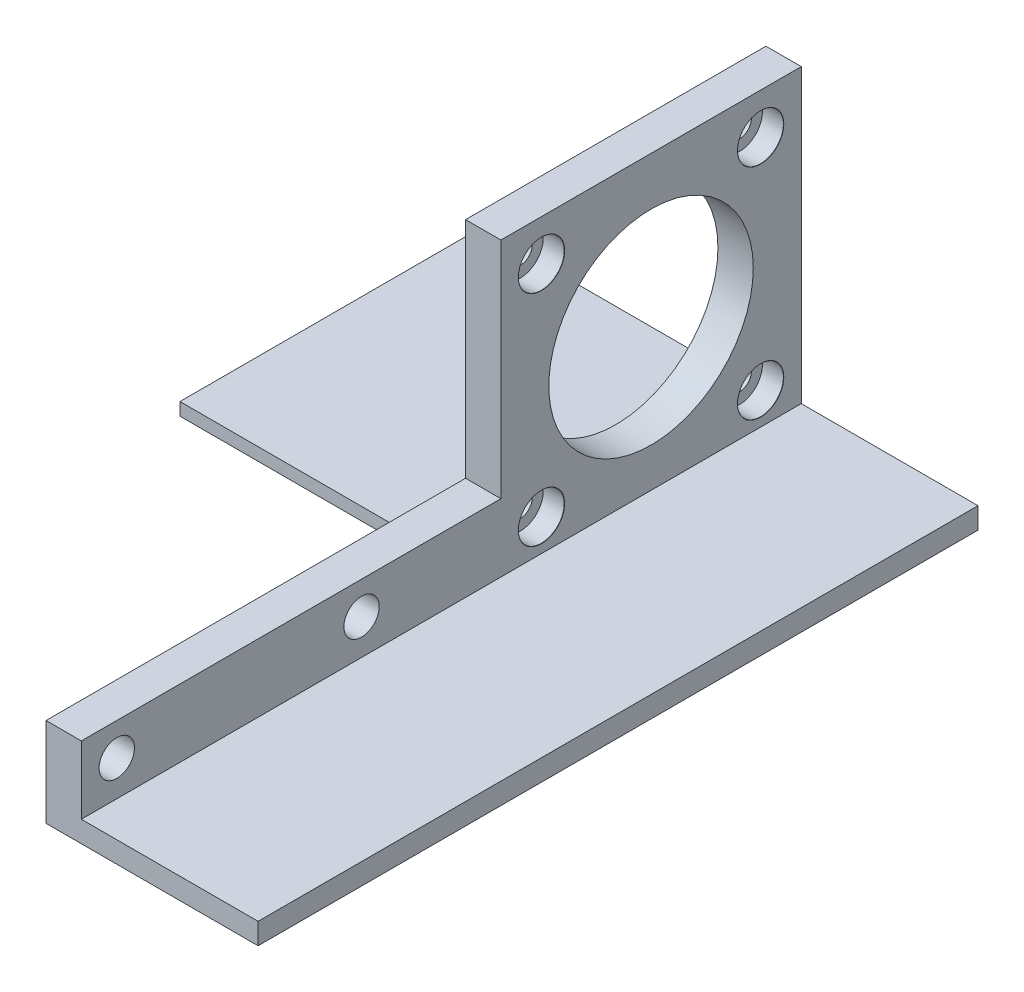
ISO-10303-21;
HEADER;
FILE_DESCRIPTION(('STEP AP214'),'2;1');
FILE_NAME('part.step','',(''),(''),'','','');
FILE_SCHEMA(('AUTOMOTIVE_DESIGN { 1 0 10303 214 1 1 1 1 }'));
ENDSEC;
DATA;
#1=APPLICATION_CONTEXT('core data for automotive mechanical design processes');
#2=APPLICATION_PROTOCOL_DEFINITION('international standard','automotive_design',2000,#1);
#3=PRODUCT_CONTEXT('',#1,'mechanical');
#4=PRODUCT('Part','Part','',(#3));
#5=PRODUCT_RELATED_PRODUCT_CATEGORY('part','',(#4));
#6=PRODUCT_DEFINITION_FORMATION('','',#4);
#7=PRODUCT_DEFINITION_CONTEXT('part definition',#1,'design');
#8=PRODUCT_DEFINITION('design','',#6,#7);
#9=PRODUCT_DEFINITION_SHAPE('','',#8);
#10=(LENGTH_UNIT() NAMED_UNIT(*) SI_UNIT(.MILLI.,.METRE.));
#11=(NAMED_UNIT(*) PLANE_ANGLE_UNIT() SI_UNIT($,.RADIAN.));
#12=(NAMED_UNIT(*) SI_UNIT($,.STERADIAN.) SOLID_ANGLE_UNIT());
#13=UNCERTAINTY_MEASURE_WITH_UNIT(LENGTH_MEASURE(1.E-05),#10,'distance_accuracy_value','');
#14=(GEOMETRIC_REPRESENTATION_CONTEXT(3) GLOBAL_UNCERTAINTY_ASSIGNED_CONTEXT((#13)) GLOBAL_UNIT_ASSIGNED_CONTEXT((#10,
#11,#12)) REPRESENTATION_CONTEXT('',''));
#15=CARTESIAN_POINT('',(0.,0.,0.));
#16=DIRECTION('',(0.,0.,1.));
#17=DIRECTION('',(1.,0.,0.));
#18=AXIS2_PLACEMENT_3D('',#15,#16,#17);
#19=CARTESIAN_POINT('',(-100.424663917664,-3.,-13.7634487006737));
#20=DIRECTION('',(0.,0.,-1.));
#21=DIRECTION('',(-1.,0.,0.));
#22=AXIS2_PLACEMENT_3D('',#19,#20,#21);
#23=PLANE('',#22);
#24=DIRECTION('',(1.,0.,0.));
#25=VECTOR('',#24,1.);
#26=CARTESIAN_POINT('',(-78.1718470904455,9.59999999999998,-13.7634487006737));
#27=LINE('',#26,#25);
#28=CARTESIAN_POINT('',(-17.5,9.59999999999998,-13.7634487006737));
#29=VERTEX_POINT('',#28);
#30=CARTESIAN_POINT('',(-12.5,9.59999999999998,-13.7634487006737));
#31=VERTEX_POINT('',#30);
#32=EDGE_CURVE('E71',#29,#31,#27,.T.);
#33=ORIENTED_EDGE('',*,*,#32,.T.);
#34=DIRECTION('',(0.,1.,0.));
#35=VECTOR('',#34,1.);
#36=CARTESIAN_POINT('',(-12.5,-1.2,-13.7634487006737));
#37=LINE('',#36,#35);
#38=CARTESIAN_POINT('',(-12.5,41.2865512993263,-13.7634487006737));
#39=VERTEX_POINT('',#38);
#40=EDGE_CURVE('E156',#31,#39,#37,.T.);
#41=ORIENTED_EDGE('',*,*,#40,.T.);
#42=DIRECTION('',(1.,0.,0.));
#43=VECTOR('',#42,1.);
#44=CARTESIAN_POINT('',(-77.5850570659675,41.2865512993263,-13.7634487006737));
#45=LINE('',#44,#43);
#46=CARTESIAN_POINT('',(-17.5,41.2865512993263,-13.7634487006737));
#47=VERTEX_POINT('',#46);
#48=EDGE_CURVE('E265',#47,#39,#45,.T.);
#49=ORIENTED_EDGE('',*,*,#48,.F.);
#50=DIRECTION('',(0.,-1.,0.));
#51=VECTOR('',#50,1.);
#52=CARTESIAN_POINT('',(-17.5,-1.2,-13.7634487006737));
#53=LINE('',#52,#51);
#54=EDGE_CURVE('E240',#47,#29,#53,.T.);
#55=ORIENTED_EDGE('',*,*,#54,.T.);
#56=EDGE_LOOP('',(#33,#41,#49,#55));
#57=FACE_BOUND('',#56,.T.);
#58=ADVANCED_FACE('F45',(#57),#23,.F.);
#59=DIRECTION('',(0.,1.,0.));
#60=VECTOR('',#59,1.);
#61=CARTESIAN_POINT('',(-17.5,-2.99999999999999,-13.7634487006737));
#62=LINE('',#61,#60);
#63=CARTESIAN_POINT('',(-17.5,-3.,-13.7634487006737));
#64=VERTEX_POINT('',#63);
#65=CARTESIAN_POINT('',(-17.5,-1.2,-13.7634487006737));
#66=VERTEX_POINT('',#65);
#67=EDGE_CURVE('E166',#64,#66,#62,.T.);
#68=ORIENTED_EDGE('',*,*,#67,.T.);
#69=DIRECTION('',(1.,0.,0.));
#70=VECTOR('',#69,1.);
#71=CARTESIAN_POINT('',(-100.424663917664,-1.2,-13.7634487006737));
#72=LINE('',#71,#70);
#73=CARTESIAN_POINT('',(-57.9,-1.2,-13.7634487006737));
#74=VERTEX_POINT('',#73);
#75=EDGE_CURVE('E288',#74,#66,#72,.T.);
#76=ORIENTED_EDGE('',*,*,#75,.F.);
#77=DIRECTION('',(0.,-1.,0.));
#78=VECTOR('',#77,1.);
#79=CARTESIAN_POINT('',(-57.9,-3.,-13.7634487006737));
#80=LINE('',#79,#78);
#81=CARTESIAN_POINT('',(-57.9,-3.,-13.7634487006737));
#82=VERTEX_POINT('',#81);
#83=EDGE_CURVE('E272',#74,#82,#80,.T.);
#84=ORIENTED_EDGE('',*,*,#83,.T.);
#85=DIRECTION('',(1.,0.,0.));
#86=VECTOR('',#85,1.);
#87=CARTESIAN_POINT('',(-100.424663917664,-3.,-13.7634487006737));
#88=LINE('',#87,#86);
#89=EDGE_CURVE('E63',#82,#64,#88,.T.);
#90=ORIENTED_EDGE('',*,*,#89,.T.);
#91=EDGE_LOOP('',(#68,#76,#84,#90));
#92=FACE_BOUND('',#91,.T.);
#93=ADVANCED_FACE('F355',(#92),#23,.F.);
#94=CARTESIAN_POINT('',(-100.424663917664,-1.2,-56.25));
#95=DIRECTION('',(0.,-1.,0.));
#96=DIRECTION('',(0.,0.,-1.));
#97=AXIS2_PLACEMENT_3D('',#94,#95,#96);
#98=PLANE('',#97);
#99=DIRECTION('',(0.,0.,-1.));
#100=VECTOR('',#99,1.);
#101=CARTESIAN_POINT('',(-17.5,-1.2,-56.25));
#102=LINE('',#101,#100);
#103=CARTESIAN_POINT('',(-17.5,-1.2,-56.25));
#104=VERTEX_POINT('',#103);
#105=EDGE_CURVE('E243',#66,#104,#102,.T.);
#106=ORIENTED_EDGE('',*,*,#105,.T.);
#107=DIRECTION('',(1.,0.,0.));
#108=VECTOR('',#107,1.);
#109=CARTESIAN_POINT('',(-100.424663917664,-1.2,-56.25));
#110=LINE('',#109,#108);
#111=CARTESIAN_POINT('',(-57.9,-1.2,-56.25));
#112=VERTEX_POINT('',#111);
#113=EDGE_CURVE('E251',#112,#104,#110,.T.);
#114=ORIENTED_EDGE('',*,*,#113,.F.);
#115=DIRECTION('',(0.,0.,1.));
#116=VECTOR('',#115,1.);
#117=CARTESIAN_POINT('',(-57.9,-1.2,-56.25));
#118=LINE('',#117,#116);
#119=EDGE_CURVE('E276',#112,#74,#118,.T.);
#120=ORIENTED_EDGE('',*,*,#119,.T.);
#121=ORIENTED_EDGE('',*,*,#75,.T.);
#122=EDGE_LOOP('',(#106,#114,#120,#121));
#123=FACE_BOUND('',#122,.T.);
#124=ADVANCED_FACE('F361',(#123),#98,.F.);
#125=CARTESIAN_POINT('',(-114.379808319264,-3.,45.5856290458793));
#126=DIRECTION('',(0.,-1.,0.));
#127=DIRECTION('',(0.,0.,-1.));
#128=AXIS2_PLACEMENT_3D('',#125,#126,#127);
#129=PLANE('',#128);
#130=DIRECTION('',(1.,0.,0.));
#131=VECTOR('',#130,1.);
#132=CARTESIAN_POINT('',(-114.379808319264,-3.,45.5856290458793));
#133=LINE('',#132,#131);
#134=CARTESIAN_POINT('',(-17.5,-3.,45.5856290458793));
#135=VERTEX_POINT('',#134);
#136=CARTESIAN_POINT('',(12.5,-3.,45.5856290458793));
#137=VERTEX_POINT('',#136);
#138=EDGE_CURVE('E11',#135,#137,#133,.T.);
#139=ORIENTED_EDGE('',*,*,#138,.F.);
#140=DIRECTION('',(0.,0.,-1.));
#141=VECTOR('',#140,1.);
#142=CARTESIAN_POINT('',(-17.5,-3.,45.5856290458793));
#143=LINE('',#142,#141);
#144=EDGE_CURVE('E152',#135,#64,#143,.T.);
#145=ORIENTED_EDGE('',*,*,#144,.T.);
#146=ORIENTED_EDGE('',*,*,#89,.F.);
#147=DIRECTION('',(0.,0.,-1.));
#148=VECTOR('',#147,1.);
#149=CARTESIAN_POINT('',(-57.9,-3.,-56.25));
#150=LINE('',#149,#148);
#151=CARTESIAN_POINT('',(-57.9,-3.,-56.25));
#152=VERTEX_POINT('',#151);
#153=EDGE_CURVE('E275',#82,#152,#150,.T.);
#154=ORIENTED_EDGE('',*,*,#153,.T.);
#155=DIRECTION('',(1.,0.,0.));
#156=VECTOR('',#155,1.);
#157=CARTESIAN_POINT('',(-114.379808319264,-3.,-56.25));
#158=LINE('',#157,#156);
#159=CARTESIAN_POINT('',(12.5,-3.,-56.25));
#160=VERTEX_POINT('',#159);
#161=EDGE_CURVE('E315',#152,#160,#158,.T.);
#162=ORIENTED_EDGE('',*,*,#161,.T.);
#163=DIRECTION('',(0.,0.,-1.));
#164=VECTOR('',#163,1.);
#165=CARTESIAN_POINT('',(12.5,-3.,45.5856290458793));
#166=LINE('',#165,#164);
#167=EDGE_CURVE('E302',#137,#160,#166,.T.);
#168=ORIENTED_EDGE('',*,*,#167,.F.);
#169=EDGE_LOOP('',(#139,#145,#146,#154,#162,#168));
#170=FACE_BOUND('',#169,.T.);
#171=ADVANCED_FACE('F47',(#170),#129,.T.);
#172=CARTESIAN_POINT('',(-114.379808319264,0.,-56.2500000000001));
#173=DIRECTION('',(0.,0.,1.));
#174=DIRECTION('',(0.,-1.,0.));
#175=AXIS2_PLACEMENT_3D('',#172,#173,#174);
#176=PLANE('',#175);
#177=DIRECTION('',(0.,-1.,0.));
#178=VECTOR('',#177,1.);
#179=CARTESIAN_POINT('',(-12.5,-1.2,-56.25));
#180=LINE('',#179,#178);
#181=CARTESIAN_POINT('',(-12.5,41.2865512993263,-56.25));
#182=VERTEX_POINT('',#181);
#183=CARTESIAN_POINT('',(-12.5,0.,-56.2500000000001));
#184=VERTEX_POINT('',#183);
#185=EDGE_CURVE('E252',#182,#184,#180,.T.);
#186=ORIENTED_EDGE('',*,*,#185,.T.);
#187=DIRECTION('',(1.,0.,0.));
#188=VECTOR('',#187,1.);
#189=CARTESIAN_POINT('',(-114.379808319264,0.,-56.2500000000001));
#190=LINE('',#189,#188);
#191=CARTESIAN_POINT('',(12.5,0.,-56.2500000000001));
#192=VERTEX_POINT('',#191);
#193=EDGE_CURVE('E318',#184,#192,#190,.T.);
#194=ORIENTED_EDGE('',*,*,#193,.T.);
#195=DIRECTION('',(0.,-1.,0.));
#196=VECTOR('',#195,1.);
#197=CARTESIAN_POINT('',(12.5,0.,-56.2500000000001));
#198=LINE('',#197,#196);
#199=EDGE_CURVE('E301',#192,#160,#198,.T.);
#200=ORIENTED_EDGE('',*,*,#199,.T.);
#201=ORIENTED_EDGE('',*,*,#161,.F.);
#202=DIRECTION('',(0.,1.,0.));
#203=VECTOR('',#202,1.);
#204=CARTESIAN_POINT('',(-57.9,-3.,-56.25));
#205=LINE('',#204,#203);
#206=EDGE_CURVE('E280',#152,#112,#205,.T.);
#207=ORIENTED_EDGE('',*,*,#206,.T.);
#208=ORIENTED_EDGE('',*,*,#113,.T.);
#209=DIRECTION('',(0.,1.,0.));
#210=VECTOR('',#209,1.);
#211=CARTESIAN_POINT('',(-17.5,-1.2,-56.25));
#212=LINE('',#211,#210);
#213=CARTESIAN_POINT('',(-17.5,41.2865512993263,-56.25));
#214=VERTEX_POINT('',#213);
#215=EDGE_CURVE('E247',#104,#214,#212,.T.);
#216=ORIENTED_EDGE('',*,*,#215,.T.);
#217=DIRECTION('',(1.,0.,0.));
#218=VECTOR('',#217,1.);
#219=CARTESIAN_POINT('',(-77.5850570659675,41.2865512993263,-56.25));
#220=LINE('',#219,#218);
#221=EDGE_CURVE('E262',#214,#182,#220,.T.);
#222=ORIENTED_EDGE('',*,*,#221,.T.);
#223=EDGE_LOOP('',(#186,#194,#200,#201,#207,#208,#216,#222));
#224=FACE_BOUND('',#223,.T.);
#225=ADVANCED_FACE('F374',(#224),#176,.F.);
#226=CARTESIAN_POINT('',(-114.379808319264,0.,45.5856290458793));
#227=DIRECTION('',(0.,-1.,0.));
#228=DIRECTION('',(0.,0.,-1.));
#229=AXIS2_PLACEMENT_3D('',#226,#227,#228);
#230=PLANE('',#229);
#231=DIRECTION('',(0.,0.,-1.));
#232=VECTOR('',#231,1.);
#233=CARTESIAN_POINT('',(-12.5,0.,45.5856290458793));
#234=LINE('',#233,#232);
#235=CARTESIAN_POINT('',(-12.5,0.,45.5856290458793));
#236=VERTEX_POINT('',#235);
#237=EDGE_CURVE('E312',#236,#184,#234,.T.);
#238=ORIENTED_EDGE('',*,*,#237,.F.);
#239=DIRECTION('',(1.,0.,0.));
#240=VECTOR('',#239,1.);
#241=CARTESIAN_POINT('',(-114.379808319264,0.,45.5856290458793));
#242=LINE('',#241,#240);
#243=CARTESIAN_POINT('',(12.5,0.,45.5856290458793));
#244=VERTEX_POINT('',#243);
#245=EDGE_CURVE('E55',#236,#244,#242,.T.);
#246=ORIENTED_EDGE('',*,*,#245,.T.);
#247=DIRECTION('',(0.,0.,-1.));
#248=VECTOR('',#247,1.);
#249=CARTESIAN_POINT('',(12.5,0.,45.5856290458793));
#250=LINE('',#249,#248);
#251=EDGE_CURVE('E297',#244,#192,#250,.T.);
#252=ORIENTED_EDGE('',*,*,#251,.T.);
#253=ORIENTED_EDGE('',*,*,#193,.F.);
#254=EDGE_LOOP('',(#238,#246,#252,#253));
#255=FACE_BOUND('',#254,.T.);
#256=ADVANCED_FACE('F372',(#255),#230,.F.);
#257=CARTESIAN_POINT('',(-114.379808319264,0.,45.5856290458793));
#258=DIRECTION('',(0.,0.,1.));
#259=DIRECTION('',(1.,0.,0.));
#260=AXIS2_PLACEMENT_3D('',#257,#258,#259);
#261=PLANE('',#260);
#262=ORIENTED_EDGE('',*,*,#245,.F.);
#263=DIRECTION('',(0.,1.,0.));
#264=VECTOR('',#263,1.);
#265=CARTESIAN_POINT('',(-12.5,-3.,45.5856290458793));
#266=LINE('',#265,#264);
#267=CARTESIAN_POINT('',(-12.5,9.59999999999999,45.5856290458793));
#268=VERTEX_POINT('',#267);
#269=EDGE_CURVE('E132',#236,#268,#266,.T.);
#270=ORIENTED_EDGE('',*,*,#269,.T.);
#271=DIRECTION('',(1.,0.,0.));
#272=VECTOR('',#271,1.);
#273=CARTESIAN_POINT('',(-78.1718470904455,9.59999999999999,45.5856290458793));
#274=LINE('',#273,#272);
#275=CARTESIAN_POINT('',(-17.5,9.59999999999999,45.5856290458793));
#276=VERTEX_POINT('',#275);
#277=EDGE_CURVE('E136',#276,#268,#274,.T.);
#278=ORIENTED_EDGE('',*,*,#277,.F.);
#279=DIRECTION('',(0.,-1.,0.));
#280=VECTOR('',#279,1.);
#281=CARTESIAN_POINT('',(-17.5,-2.99999999999999,45.5856290458793));
#282=LINE('',#281,#280);
#283=EDGE_CURVE('E171',#276,#135,#282,.T.);
#284=ORIENTED_EDGE('',*,*,#283,.T.);
#285=ORIENTED_EDGE('',*,*,#138,.T.);
#286=DIRECTION('',(0.,-1.,0.));
#287=VECTOR('',#286,1.);
#288=CARTESIAN_POINT('',(12.5,0.,45.5856290458793));
#289=LINE('',#288,#287);
#290=EDGE_CURVE('E284',#244,#137,#289,.T.);
#291=ORIENTED_EDGE('',*,*,#290,.F.);
#292=EDGE_LOOP('',(#262,#270,#278,#284,#285,#291));
#293=FACE_BOUND('',#292,.T.);
#294=ADVANCED_FACE('F134',(#293),#261,.T.);
#295=CARTESIAN_POINT('',(12.5,0.,0.));
#296=DIRECTION('',(1.,0.,0.));
#297=DIRECTION('',(0.,0.,-1.));
#298=AXIS2_PLACEMENT_3D('',#295,#296,#297);
#299=PLANE('',#298);
#300=ORIENTED_EDGE('',*,*,#251,.F.);
#301=ORIENTED_EDGE('',*,*,#290,.T.);
#302=ORIENTED_EDGE('',*,*,#167,.T.);
#303=ORIENTED_EDGE('',*,*,#199,.F.);
#304=EDGE_LOOP('',(#300,#301,#302,#303));
#305=FACE_BOUND('',#304,.T.);
#306=ADVANCED_FACE('F365',(#305),#299,.T.);
#307=CARTESIAN_POINT('',(-57.9,20.,-35.));
#308=DIRECTION('',(1.,0.,0.));
#309=DIRECTION('',(0.,0.,-1.));
#310=AXIS2_PLACEMENT_3D('',#307,#308,#309);
#311=PLANE('',#310);
#312=ORIENTED_EDGE('',*,*,#153,.F.);
#313=ORIENTED_EDGE('',*,*,#83,.F.);
#314=ORIENTED_EDGE('',*,*,#119,.F.);
#315=ORIENTED_EDGE('',*,*,#206,.F.);
#316=EDGE_LOOP('',(#312,#313,#314,#315));
#317=FACE_BOUND('',#316,.T.);
#318=ADVANCED_FACE('F368',(#317),#311,.F.);
#319=CARTESIAN_POINT('',(-12.5,0.,0.));
#320=DIRECTION('',(1.,0.,0.));
#321=DIRECTION('',(0.,0.,-1.));
#322=AXIS2_PLACEMENT_3D('',#319,#320,#321);
#323=PLANE('',#322);
#324=CARTESIAN_POINT('',(-12.5,5.,5.94999999999999));
#325=DIRECTION('',(1.,0.,0.));
#326=DIRECTION('',(0.,0.,-1.));
#327=AXIS2_PLACEMENT_3D('',#324,#325,#326);
#328=CIRCLE('',#327,2.5);
#329=CARTESIAN_POINT('',(-12.5,5.,3.44999999999999));
#330=VERTEX_POINT('',#329);
#331=EDGE_CURVE('E144',#330,#330,#328,.T.);
#332=ORIENTED_EDGE('',*,*,#331,.F.);
#333=EDGE_LOOP('',(#332));
#334=FACE_BOUND('',#333,.T.);
#335=CARTESIAN_POINT('',(-12.5,4.99999999999999,40.5741705012821));
#336=DIRECTION('',(1.,0.,0.));
#337=DIRECTION('',(0.,0.,-1.));
#338=AXIS2_PLACEMENT_3D('',#335,#336,#337);
#339=CIRCLE('',#338,2.49999999999999);
#340=CARTESIAN_POINT('',(-12.5,4.99999999999999,38.0741705012821));
#341=VERTEX_POINT('',#340);
#342=EDGE_CURVE('E700',#341,#341,#339,.T.);
#343=ORIENTED_EDGE('',*,*,#342,.F.);
#344=EDGE_LOOP('',(#343));
#345=FACE_BOUND('',#344,.T.);
#346=CARTESIAN_POINT('',(-12.5,20.,-35.));
#347=DIRECTION('',(1.,0.,0.));
#348=DIRECTION('',(0.,0.,-1.));
#349=AXIS2_PLACEMENT_3D('',#346,#347,#348);
#350=CIRCLE('',#349,14.462);
#351=CARTESIAN_POINT('',(-12.5,20.,-49.462));
#352=VERTEX_POINT('',#351);
#353=EDGE_CURVE('E167',#352,#352,#350,.T.);
#354=ORIENTED_EDGE('',*,*,#353,.F.);
#355=EDGE_LOOP('',(#354));
#356=FACE_BOUND('',#355,.T.);
#357=CARTESIAN_POINT('',(-12.5,4.5,-19.5));
#358=DIRECTION('',(1.,0.,0.));
#359=DIRECTION('',(0.,0.,-1.));
#360=AXIS2_PLACEMENT_3D('',#357,#358,#359);
#361=CIRCLE('',#360,3.275);
#362=CARTESIAN_POINT('',(-12.5,4.5,-22.775));
#363=VERTEX_POINT('',#362);
#364=EDGE_CURVE('E172',#363,#363,#361,.T.);
#365=ORIENTED_EDGE('',*,*,#364,.F.);
#366=EDGE_LOOP('',(#365));
#367=FACE_BOUND('',#366,.T.);
#368=CARTESIAN_POINT('',(-12.5,4.50000000000001,-50.5));
#369=DIRECTION('',(1.,0.,0.));
#370=DIRECTION('',(0.,0.,-1.));
#371=AXIS2_PLACEMENT_3D('',#368,#369,#370);
#372=CIRCLE('',#371,3.275);
#373=CARTESIAN_POINT('',(-12.5,4.50000000000001,-53.775));
#374=VERTEX_POINT('',#373);
#375=EDGE_CURVE('E189',#374,#374,#372,.T.);
#376=ORIENTED_EDGE('',*,*,#375,.F.);
#377=EDGE_LOOP('',(#376));
#378=FACE_BOUND('',#377,.T.);
#379=CARTESIAN_POINT('',(-12.5,35.5,-50.5));
#380=DIRECTION('',(1.,0.,0.));
#381=DIRECTION('',(0.,0.,-1.));
#382=AXIS2_PLACEMENT_3D('',#379,#380,#381);
#383=CIRCLE('',#382,3.275);
#384=CARTESIAN_POINT('',(-12.5,35.5,-53.775));
#385=VERTEX_POINT('',#384);
#386=EDGE_CURVE('E206',#385,#385,#383,.T.);
#387=ORIENTED_EDGE('',*,*,#386,.F.);
#388=EDGE_LOOP('',(#387));
#389=FACE_BOUND('',#388,.T.);
#390=CARTESIAN_POINT('',(-12.5,35.5,-19.5));
#391=DIRECTION('',(1.,0.,0.));
#392=DIRECTION('',(0.,0.,-1.));
#393=AXIS2_PLACEMENT_3D('',#390,#391,#392);
#394=CIRCLE('',#393,3.275);
#395=CARTESIAN_POINT('',(-12.5,35.5,-22.775));
#396=VERTEX_POINT('',#395);
#397=EDGE_CURVE('E223',#396,#396,#394,.T.);
#398=ORIENTED_EDGE('',*,*,#397,.F.);
#399=EDGE_LOOP('',(#398));
#400=FACE_BOUND('',#399,.T.);
#401=ORIENTED_EDGE('',*,*,#237,.T.);
#402=ORIENTED_EDGE('',*,*,#185,.F.);
#403=DIRECTION('',(0.,0.,-1.));
#404=VECTOR('',#403,1.);
#405=CARTESIAN_POINT('',(-12.5,41.2865512993263,-56.25));
#406=LINE('',#405,#404);
#407=EDGE_CURVE('E258',#39,#182,#406,.T.);
#408=ORIENTED_EDGE('',*,*,#407,.F.);
#409=ORIENTED_EDGE('',*,*,#40,.F.);
#410=DIRECTION('',(0.,0.,-1.));
#411=VECTOR('',#410,1.);
#412=CARTESIAN_POINT('',(-12.5,9.59999999999999,45.5856290458793));
#413=LINE('',#412,#411);
#414=EDGE_CURVE('E143',#268,#31,#413,.T.);
#415=ORIENTED_EDGE('',*,*,#414,.F.);
#416=ORIENTED_EDGE('',*,*,#269,.F.);
#417=EDGE_LOOP('',(#401,#402,#408,#409,#415,#416));
#418=FACE_BOUND('',#417,.T.);
#419=ADVANCED_FACE('F154',(#334,#345,#356,#367,#378,#389,#400,#418),#323,.T.);
#420=CARTESIAN_POINT('',(-77.5850570659675,41.2865512993263,-56.25));
#421=DIRECTION('',(0.,-1.,0.));
#422=DIRECTION('',(0.,0.,-1.));
#423=AXIS2_PLACEMENT_3D('',#420,#421,#422);
#424=PLANE('',#423);
#425=ORIENTED_EDGE('',*,*,#221,.F.);
#426=DIRECTION('',(0.,0.,1.));
#427=VECTOR('',#426,1.);
#428=CARTESIAN_POINT('',(-17.5,41.2865512993263,-56.25));
#429=LINE('',#428,#427);
#430=EDGE_CURVE('E244',#214,#47,#429,.T.);
#431=ORIENTED_EDGE('',*,*,#430,.T.);
#432=ORIENTED_EDGE('',*,*,#48,.T.);
#433=ORIENTED_EDGE('',*,*,#407,.T.);
#434=EDGE_LOOP('',(#425,#431,#432,#433));
#435=FACE_BOUND('',#434,.T.);
#436=ADVANCED_FACE('F432',(#435),#424,.F.);
#437=CARTESIAN_POINT('',(-17.5,20.,-35.));
#438=DIRECTION('',(1.,0.,0.));
#439=DIRECTION('',(0.,0.,-1.));
#440=AXIS2_PLACEMENT_3D('',#437,#438,#439);
#441=PLANE('',#440);
#442=CARTESIAN_POINT('',(-17.5,5.,5.94999999999999));
#443=DIRECTION('',(-1.,0.,0.));
#444=DIRECTION('',(0.,0.,1.));
#445=AXIS2_PLACEMENT_3D('',#442,#443,#444);
#446=CIRCLE('',#445,2.5);
#447=CARTESIAN_POINT('',(-17.5,5.,8.44999999999999));
#448=VERTEX_POINT('',#447);
#449=EDGE_CURVE('E698',#448,#448,#446,.T.);
#450=ORIENTED_EDGE('',*,*,#449,.F.);
#451=EDGE_LOOP('',(#450));
#452=FACE_BOUND('',#451,.T.);
#453=CARTESIAN_POINT('',(-17.5,4.99999999999999,40.5741705012821));
#454=DIRECTION('',(-1.,0.,0.));
#455=DIRECTION('',(0.,0.,1.));
#456=AXIS2_PLACEMENT_3D('',#453,#454,#455);
#457=CIRCLE('',#456,2.49999999999999);
#458=CARTESIAN_POINT('',(-17.5,4.99999999999999,43.0741705012821));
#459=VERTEX_POINT('',#458);
#460=EDGE_CURVE('E701',#459,#459,#457,.T.);
#461=ORIENTED_EDGE('',*,*,#460,.F.);
#462=EDGE_LOOP('',(#461));
#463=FACE_BOUND('',#462,.T.);
#464=CARTESIAN_POINT('',(-17.5,20.,-35.));
#465=DIRECTION('',(1.,0.,0.));
#466=DIRECTION('',(0.,0.,-1.));
#467=AXIS2_PLACEMENT_3D('',#464,#465,#466);
#468=CIRCLE('',#467,14.462);
#469=CARTESIAN_POINT('',(-17.5,20.,-49.462));
#470=VERTEX_POINT('',#469);
#471=EDGE_CURVE('E49',#470,#470,#468,.T.);
#472=ORIENTED_EDGE('',*,*,#471,.T.);
#473=EDGE_LOOP('',(#472));
#474=FACE_BOUND('',#473,.T.);
#475=CARTESIAN_POINT('',(-17.5,4.5,-19.5));
#476=DIRECTION('',(1.,0.,0.));
#477=DIRECTION('',(0.,0.,-1.));
#478=AXIS2_PLACEMENT_3D('',#475,#476,#477);
#479=CIRCLE('',#478,1.7);
#480=CARTESIAN_POINT('',(-17.5,4.5,-21.2));
#481=VERTEX_POINT('',#480);
#482=EDGE_CURVE('E188',#481,#481,#479,.T.);
#483=ORIENTED_EDGE('',*,*,#482,.T.);
#484=EDGE_LOOP('',(#483));
#485=FACE_BOUND('',#484,.T.);
#486=CARTESIAN_POINT('',(-17.5,4.50000000000001,-50.5));
#487=DIRECTION('',(1.,0.,0.));
#488=DIRECTION('',(0.,0.,-1.));
#489=AXIS2_PLACEMENT_3D('',#486,#487,#488);
#490=CIRCLE('',#489,1.7);
#491=CARTESIAN_POINT('',(-17.5,4.50000000000001,-52.2));
#492=VERTEX_POINT('',#491);
#493=EDGE_CURVE('E205',#492,#492,#490,.T.);
#494=ORIENTED_EDGE('',*,*,#493,.T.);
#495=EDGE_LOOP('',(#494));
#496=FACE_BOUND('',#495,.T.);
#497=CARTESIAN_POINT('',(-17.5,35.5,-50.5));
#498=DIRECTION('',(1.,0.,0.));
#499=DIRECTION('',(0.,0.,-1.));
#500=AXIS2_PLACEMENT_3D('',#497,#498,#499);
#501=CIRCLE('',#500,1.7);
#502=CARTESIAN_POINT('',(-17.5,35.5,-52.2));
#503=VERTEX_POINT('',#502);
#504=EDGE_CURVE('E222',#503,#503,#501,.T.);
#505=ORIENTED_EDGE('',*,*,#504,.T.);
#506=EDGE_LOOP('',(#505));
#507=FACE_BOUND('',#506,.T.);
#508=CARTESIAN_POINT('',(-17.5,35.5,-19.5));
#509=DIRECTION('',(1.,0.,0.));
#510=DIRECTION('',(0.,0.,-1.));
#511=AXIS2_PLACEMENT_3D('',#508,#509,#510);
#512=CIRCLE('',#511,1.7);
#513=CARTESIAN_POINT('',(-17.5,35.5,-21.2));
#514=VERTEX_POINT('',#513);
#515=EDGE_CURVE('E239',#514,#514,#512,.T.);
#516=ORIENTED_EDGE('',*,*,#515,.T.);
#517=EDGE_LOOP('',(#516));
#518=FACE_BOUND('',#517,.T.);
#519=ORIENTED_EDGE('',*,*,#105,.F.);
#520=ORIENTED_EDGE('',*,*,#67,.F.);
#521=ORIENTED_EDGE('',*,*,#144,.F.);
#522=ORIENTED_EDGE('',*,*,#283,.F.);
#523=DIRECTION('',(0.,0.,1.));
#524=VECTOR('',#523,1.);
#525=CARTESIAN_POINT('',(-17.5,9.59999999999999,45.5856290458793));
#526=LINE('',#525,#524);
#527=EDGE_CURVE('E150',#29,#276,#526,.T.);
#528=ORIENTED_EDGE('',*,*,#527,.F.);
#529=ORIENTED_EDGE('',*,*,#54,.F.);
#530=ORIENTED_EDGE('',*,*,#430,.F.);
#531=ORIENTED_EDGE('',*,*,#215,.F.);
#532=EDGE_LOOP('',(#519,#520,#521,#522,#528,#529,#530,#531));
#533=FACE_BOUND('',#532,.T.);
#534=ADVANCED_FACE('F335',(#452,#463,#474,#485,#496,#507,#518,#533),#441,.F.);
#535=CARTESIAN_POINT('',(-12.5,35.5,-19.5));
#536=DIRECTION('',(1.,0.,0.));
#537=DIRECTION('',(0.,0.,-1.));
#538=AXIS2_PLACEMENT_3D('',#535,#536,#537);
#539=CYLINDRICAL_SURFACE('',#538,1.7);
#540=CARTESIAN_POINT('',(-15.5,35.5,-19.5));
#541=DIRECTION('',(1.,0.,0.));
#542=DIRECTION('',(0.,0.,-1.));
#543=AXIS2_PLACEMENT_3D('',#540,#541,#542);
#544=CIRCLE('',#543,1.70000000000001);
#545=CARTESIAN_POINT('',(-15.5,35.5,-21.2));
#546=VERTEX_POINT('',#545);
#547=EDGE_CURVE('E235',#546,#546,#544,.T.);
#548=ORIENTED_EDGE('',*,*,#547,.T.);
#549=EDGE_LOOP('',(#548));
#550=FACE_BOUND('',#549,.T.);
#551=ORIENTED_EDGE('',*,*,#515,.F.);
#552=EDGE_LOOP('',(#551));
#553=FACE_BOUND('',#552,.T.);
#554=ADVANCED_FACE('F462',(#550,#553),#539,.F.);
#555=CARTESIAN_POINT('',(-15.5,38.75,-19.5));
#556=DIRECTION('',(-1.,0.,0.));
#557=DIRECTION('',(0.,0.,1.));
#558=AXIS2_PLACEMENT_3D('',#555,#556,#557);
#559=PLANE('',#558);
#560=ORIENTED_EDGE('',*,*,#547,.F.);
#561=EDGE_LOOP('',(#560));
#562=FACE_BOUND('',#561,.T.);
#563=CARTESIAN_POINT('',(-15.5,35.5,-19.5));
#564=DIRECTION('',(1.,0.,0.));
#565=DIRECTION('',(0.,0.,-1.));
#566=AXIS2_PLACEMENT_3D('',#563,#564,#565);
#567=CIRCLE('',#566,3.25);
#568=CARTESIAN_POINT('',(-15.5,35.5,-22.75));
#569=VERTEX_POINT('',#568);
#570=EDGE_CURVE('E231',#569,#569,#567,.T.);
#571=ORIENTED_EDGE('',*,*,#570,.T.);
#572=EDGE_LOOP('',(#571));
#573=FACE_BOUND('',#572,.T.);
#574=ADVANCED_FACE('F454',(#562,#573),#559,.F.);
#575=CARTESIAN_POINT('',(-12.5,35.5,-19.5));
#576=DIRECTION('',(1.,0.,0.));
#577=DIRECTION('',(0.,0.,-1.));
#578=AXIS2_PLACEMENT_3D('',#575,#576,#577);
#579=CYLINDRICAL_SURFACE('',#578,3.25);
#580=ORIENTED_EDGE('',*,*,#570,.F.);
#581=EDGE_LOOP('',(#580));
#582=FACE_BOUND('',#581,.T.);
#583=CARTESIAN_POINT('',(-12.525,35.5,-19.5));
#584=DIRECTION('',(1.,0.,0.));
#585=DIRECTION('',(0.,0.,-1.));
#586=AXIS2_PLACEMENT_3D('',#583,#584,#585);
#587=CIRCLE('',#586,3.25);
#588=CARTESIAN_POINT('',(-12.525,35.5,-22.75));
#589=VERTEX_POINT('',#588);
#590=EDGE_CURVE('E227',#589,#589,#587,.T.);
#591=ORIENTED_EDGE('',*,*,#590,.T.);
#592=EDGE_LOOP('',(#591));
#593=FACE_BOUND('',#592,.T.);
#594=ADVANCED_FACE('F444',(#582,#593),#579,.F.);
#595=CARTESIAN_POINT('',(-12.5,35.5,-19.5));
#596=DIRECTION('',(1.,0.,0.));
#597=DIRECTION('',(0.,0.,-1.));
#598=AXIS2_PLACEMENT_3D('',#595,#596,#597);
#599=CONICAL_SURFACE('',#598,3.275,0.785398163397414);
#600=ORIENTED_EDGE('',*,*,#590,.F.);
#601=EDGE_LOOP('',(#600));
#602=FACE_BOUND('',#601,.T.);
#603=ORIENTED_EDGE('',*,*,#397,.T.);
#604=EDGE_LOOP('',(#603));
#605=FACE_BOUND('',#604,.T.);
#606=ADVANCED_FACE('F441',(#602,#605),#599,.F.);
#607=CARTESIAN_POINT('',(-12.5,35.5,-50.5));
#608=DIRECTION('',(1.,0.,0.));
#609=DIRECTION('',(0.,0.,-1.));
#610=AXIS2_PLACEMENT_3D('',#607,#608,#609);
#611=CYLINDRICAL_SURFACE('',#610,1.7);
#612=CARTESIAN_POINT('',(-15.5,35.5,-50.5));
#613=DIRECTION('',(1.,0.,0.));
#614=DIRECTION('',(0.,0.,-1.));
#615=AXIS2_PLACEMENT_3D('',#612,#613,#614);
#616=CIRCLE('',#615,1.70000000000001);
#617=CARTESIAN_POINT('',(-15.5,35.5,-52.2));
#618=VERTEX_POINT('',#617);
#619=EDGE_CURVE('E218',#618,#618,#616,.T.);
#620=ORIENTED_EDGE('',*,*,#619,.T.);
#621=EDGE_LOOP('',(#620));
#622=FACE_BOUND('',#621,.T.);
#623=ORIENTED_EDGE('',*,*,#504,.F.);
#624=EDGE_LOOP('',(#623));
#625=FACE_BOUND('',#624,.T.);
#626=ADVANCED_FACE('F443',(#622,#625),#611,.F.);
#627=CARTESIAN_POINT('',(-15.5,38.75,-50.5));
#628=DIRECTION('',(-1.,0.,0.));
#629=DIRECTION('',(0.,0.,1.));
#630=AXIS2_PLACEMENT_3D('',#627,#628,#629);
#631=PLANE('',#630);
#632=ORIENTED_EDGE('',*,*,#619,.F.);
#633=EDGE_LOOP('',(#632));
#634=FACE_BOUND('',#633,.T.);
#635=CARTESIAN_POINT('',(-15.5,35.5,-50.5));
#636=DIRECTION('',(1.,0.,0.));
#637=DIRECTION('',(0.,0.,-1.));
#638=AXIS2_PLACEMENT_3D('',#635,#636,#637);
#639=CIRCLE('',#638,3.25);
#640=CARTESIAN_POINT('',(-15.5,35.5,-53.75));
#641=VERTEX_POINT('',#640);
#642=EDGE_CURVE('E214',#641,#641,#639,.T.);
#643=ORIENTED_EDGE('',*,*,#642,.T.);
#644=EDGE_LOOP('',(#643));
#645=FACE_BOUND('',#644,.T.);
#646=ADVANCED_FACE('F451',(#634,#645),#631,.F.);
#647=CARTESIAN_POINT('',(-12.5,35.5,-50.5));
#648=DIRECTION('',(1.,0.,0.));
#649=DIRECTION('',(0.,0.,-1.));
#650=AXIS2_PLACEMENT_3D('',#647,#648,#649);
#651=CYLINDRICAL_SURFACE('',#650,3.25);
#652=ORIENTED_EDGE('',*,*,#642,.F.);
#653=EDGE_LOOP('',(#652));
#654=FACE_BOUND('',#653,.T.);
#655=CARTESIAN_POINT('',(-12.525,35.5,-50.5));
#656=DIRECTION('',(1.,0.,0.));
#657=DIRECTION('',(0.,0.,-1.));
#658=AXIS2_PLACEMENT_3D('',#655,#656,#657);
#659=CIRCLE('',#658,3.25);
#660=CARTESIAN_POINT('',(-12.525,35.5,-53.75));
#661=VERTEX_POINT('',#660);
#662=EDGE_CURVE('E210',#661,#661,#659,.T.);
#663=ORIENTED_EDGE('',*,*,#662,.T.);
#664=EDGE_LOOP('',(#663));
#665=FACE_BOUND('',#664,.T.);
#666=ADVANCED_FACE('F534',(#654,#665),#651,.F.);
#667=CARTESIAN_POINT('',(-12.5,35.5,-50.5));
#668=DIRECTION('',(1.,0.,0.));
#669=DIRECTION('',(0.,0.,-1.));
#670=AXIS2_PLACEMENT_3D('',#667,#668,#669);
#671=CONICAL_SURFACE('',#670,3.275,0.785398163397414);
#672=ORIENTED_EDGE('',*,*,#662,.F.);
#673=EDGE_LOOP('',(#672));
#674=FACE_BOUND('',#673,.T.);
#675=ORIENTED_EDGE('',*,*,#386,.T.);
#676=EDGE_LOOP('',(#675));
#677=FACE_BOUND('',#676,.T.);
#678=ADVANCED_FACE('F542',(#674,#677),#671,.F.);
#679=CARTESIAN_POINT('',(-12.5,4.50000000000001,-50.5));
#680=DIRECTION('',(1.,0.,0.));
#681=DIRECTION('',(0.,0.,-1.));
#682=AXIS2_PLACEMENT_3D('',#679,#680,#681);
#683=CYLINDRICAL_SURFACE('',#682,1.7);
#684=CARTESIAN_POINT('',(-15.5,4.50000000000001,-50.5));
#685=DIRECTION('',(1.,0.,0.));
#686=DIRECTION('',(0.,0.,-1.));
#687=AXIS2_PLACEMENT_3D('',#684,#685,#686);
#688=CIRCLE('',#687,1.7);
#689=CARTESIAN_POINT('',(-15.5,4.50000000000001,-52.2));
#690=VERTEX_POINT('',#689);
#691=EDGE_CURVE('E201',#690,#690,#688,.T.);
#692=ORIENTED_EDGE('',*,*,#691,.T.);
#693=EDGE_LOOP('',(#692));
#694=FACE_BOUND('',#693,.T.);
#695=ORIENTED_EDGE('',*,*,#493,.F.);
#696=EDGE_LOOP('',(#695));
#697=FACE_BOUND('',#696,.T.);
#698=ADVANCED_FACE('F551',(#694,#697),#683,.F.);
#699=CARTESIAN_POINT('',(-15.5,7.75000000000001,-50.5));
#700=DIRECTION('',(-1.,0.,0.));
#701=DIRECTION('',(0.,0.,1.));
#702=AXIS2_PLACEMENT_3D('',#699,#700,#701);
#703=PLANE('',#702);
#704=ORIENTED_EDGE('',*,*,#691,.F.);
#705=EDGE_LOOP('',(#704));
#706=FACE_BOUND('',#705,.T.);
#707=CARTESIAN_POINT('',(-15.5,4.50000000000001,-50.5));
#708=DIRECTION('',(1.,0.,0.));
#709=DIRECTION('',(0.,0.,-1.));
#710=AXIS2_PLACEMENT_3D('',#707,#708,#709);
#711=CIRCLE('',#710,3.25);
#712=CARTESIAN_POINT('',(-15.5,4.50000000000001,-53.75));
#713=VERTEX_POINT('',#712);
#714=EDGE_CURVE('E197',#713,#713,#711,.T.);
#715=ORIENTED_EDGE('',*,*,#714,.T.);
#716=EDGE_LOOP('',(#715));
#717=FACE_BOUND('',#716,.T.);
#718=ADVANCED_FACE('F560',(#706,#717),#703,.F.);
#719=CARTESIAN_POINT('',(-12.5,4.50000000000001,-50.5));
#720=DIRECTION('',(1.,0.,0.));
#721=DIRECTION('',(0.,0.,-1.));
#722=AXIS2_PLACEMENT_3D('',#719,#720,#721);
#723=CYLINDRICAL_SURFACE('',#722,3.25);
#724=ORIENTED_EDGE('',*,*,#714,.F.);
#725=EDGE_LOOP('',(#724));
#726=FACE_BOUND('',#725,.T.);
#727=CARTESIAN_POINT('',(-12.525,4.50000000000001,-50.5));
#728=DIRECTION('',(1.,0.,0.));
#729=DIRECTION('',(0.,0.,-1.));
#730=AXIS2_PLACEMENT_3D('',#727,#728,#729);
#731=CIRCLE('',#730,3.25);
#732=CARTESIAN_POINT('',(-12.525,4.50000000000001,-53.75));
#733=VERTEX_POINT('',#732);
#734=EDGE_CURVE('E193',#733,#733,#731,.T.);
#735=ORIENTED_EDGE('',*,*,#734,.T.);
#736=EDGE_LOOP('',(#735));
#737=FACE_BOUND('',#736,.T.);
#738=ADVANCED_FACE('F351',(#726,#737),#723,.F.);
#739=CARTESIAN_POINT('',(-12.5,4.50000000000001,-50.5));
#740=DIRECTION('',(1.,0.,0.));
#741=DIRECTION('',(0.,0.,-1.));
#742=AXIS2_PLACEMENT_3D('',#739,#740,#741);
#743=CONICAL_SURFACE('',#742,3.275,0.785398163397448);
#744=ORIENTED_EDGE('',*,*,#734,.F.);
#745=EDGE_LOOP('',(#744));
#746=FACE_BOUND('',#745,.T.);
#747=ORIENTED_EDGE('',*,*,#375,.T.);
#748=EDGE_LOOP('',(#747));
#749=FACE_BOUND('',#748,.T.);
#750=ADVANCED_FACE('F341',(#746,#749),#743,.F.);
#751=CARTESIAN_POINT('',(-12.5,4.5,-19.5));
#752=DIRECTION('',(1.,0.,0.));
#753=DIRECTION('',(0.,0.,-1.));
#754=AXIS2_PLACEMENT_3D('',#751,#752,#753);
#755=CYLINDRICAL_SURFACE('',#754,1.7);
#756=CARTESIAN_POINT('',(-15.5,4.5,-19.5));
#757=DIRECTION('',(1.,0.,0.));
#758=DIRECTION('',(0.,0.,-1.));
#759=AXIS2_PLACEMENT_3D('',#756,#757,#758);
#760=CIRCLE('',#759,1.7);
#761=CARTESIAN_POINT('',(-15.5,4.5,-21.2));
#762=VERTEX_POINT('',#761);
#763=EDGE_CURVE('E184',#762,#762,#760,.T.);
#764=ORIENTED_EDGE('',*,*,#763,.T.);
#765=EDGE_LOOP('',(#764));
#766=FACE_BOUND('',#765,.T.);
#767=ORIENTED_EDGE('',*,*,#482,.F.);
#768=EDGE_LOOP('',(#767));
#769=FACE_BOUND('',#768,.T.);
#770=ADVANCED_FACE('F338',(#766,#769),#755,.F.);
#771=CARTESIAN_POINT('',(-15.5,7.75,-19.5));
#772=DIRECTION('',(-1.,0.,0.));
#773=DIRECTION('',(0.,0.,1.));
#774=AXIS2_PLACEMENT_3D('',#771,#772,#773);
#775=PLANE('',#774);
#776=ORIENTED_EDGE('',*,*,#763,.F.);
#777=EDGE_LOOP('',(#776));
#778=FACE_BOUND('',#777,.T.);
#779=CARTESIAN_POINT('',(-15.5,4.5,-19.5));
#780=DIRECTION('',(1.,0.,0.));
#781=DIRECTION('',(0.,0.,-1.));
#782=AXIS2_PLACEMENT_3D('',#779,#780,#781);
#783=CIRCLE('',#782,3.25);
#784=CARTESIAN_POINT('',(-15.5,4.5,-22.75));
#785=VERTEX_POINT('',#784);
#786=EDGE_CURVE('E180',#785,#785,#783,.T.);
#787=ORIENTED_EDGE('',*,*,#786,.T.);
#788=EDGE_LOOP('',(#787));
#789=FACE_BOUND('',#788,.T.);
#790=ADVANCED_FACE('F340',(#778,#789),#775,.F.);
#791=CARTESIAN_POINT('',(-12.5,4.5,-19.5));
#792=DIRECTION('',(1.,0.,0.));
#793=DIRECTION('',(0.,0.,-1.));
#794=AXIS2_PLACEMENT_3D('',#791,#792,#793);
#795=CYLINDRICAL_SURFACE('',#794,3.25);
#796=ORIENTED_EDGE('',*,*,#786,.F.);
#797=EDGE_LOOP('',(#796));
#798=FACE_BOUND('',#797,.T.);
#799=CARTESIAN_POINT('',(-12.525,4.5,-19.5));
#800=DIRECTION('',(1.,0.,0.));
#801=DIRECTION('',(0.,0.,-1.));
#802=AXIS2_PLACEMENT_3D('',#799,#800,#801);
#803=CIRCLE('',#802,3.25);
#804=CARTESIAN_POINT('',(-12.525,4.5,-22.75));
#805=VERTEX_POINT('',#804);
#806=EDGE_CURVE('E176',#805,#805,#803,.T.);
#807=ORIENTED_EDGE('',*,*,#806,.T.);
#808=EDGE_LOOP('',(#807));
#809=FACE_BOUND('',#808,.T.);
#810=ADVANCED_FACE('F348',(#798,#809),#795,.F.);
#811=CARTESIAN_POINT('',(-12.5,4.5,-19.5));
#812=DIRECTION('',(1.,0.,0.));
#813=DIRECTION('',(0.,0.,-1.));
#814=AXIS2_PLACEMENT_3D('',#811,#812,#813);
#815=CONICAL_SURFACE('',#814,3.275,0.785398163397448);
#816=ORIENTED_EDGE('',*,*,#806,.F.);
#817=EDGE_LOOP('',(#816));
#818=FACE_BOUND('',#817,.T.);
#819=ORIENTED_EDGE('',*,*,#364,.T.);
#820=EDGE_LOOP('',(#819));
#821=FACE_BOUND('',#820,.T.);
#822=ADVANCED_FACE('F407',(#818,#821),#815,.F.);
#823=CARTESIAN_POINT('',(-22.5,20.,-35.));
#824=DIRECTION('',(1.,0.,0.));
#825=DIRECTION('',(0.,0.,-1.));
#826=AXIS2_PLACEMENT_3D('',#823,#824,#825);
#827=CYLINDRICAL_SURFACE('',#826,14.462);
#828=ORIENTED_EDGE('',*,*,#353,.T.);
#829=EDGE_LOOP('',(#828));
#830=FACE_BOUND('',#829,.T.);
#831=ORIENTED_EDGE('',*,*,#471,.F.);
#832=EDGE_LOOP('',(#831));
#833=FACE_BOUND('',#832,.T.);
#834=ADVANCED_FACE('F406',(#830,#833),#827,.F.);
#835=CARTESIAN_POINT('',(-78.1718470904455,9.59999999999999,45.5856290458793));
#836=DIRECTION('',(0.,-1.,0.));
#837=DIRECTION('',(0.,0.,-1.));
#838=AXIS2_PLACEMENT_3D('',#835,#836,#837);
#839=PLANE('',#838);
#840=ORIENTED_EDGE('',*,*,#32,.F.);
#841=ORIENTED_EDGE('',*,*,#527,.T.);
#842=ORIENTED_EDGE('',*,*,#277,.T.);
#843=ORIENTED_EDGE('',*,*,#414,.T.);
#844=EDGE_LOOP('',(#840,#841,#842,#843));
#845=FACE_BOUND('',#844,.T.);
#846=ADVANCED_FACE('F148',(#845),#839,.F.);
#847=CARTESIAN_POINT('',(-7.49999999999998,4.99999999999999,40.5741705012821));
#848=DIRECTION('',(-1.,0.,0.));
#849=DIRECTION('',(0.,0.,1.));
#850=AXIS2_PLACEMENT_3D('',#847,#848,#849);
#851=CYLINDRICAL_SURFACE('',#850,2.49999999999999);
#852=ORIENTED_EDGE('',*,*,#342,.T.);
#853=EDGE_LOOP('',(#852));
#854=FACE_BOUND('',#853,.T.);
#855=ORIENTED_EDGE('',*,*,#460,.T.);
#856=EDGE_LOOP('',(#855));
#857=FACE_BOUND('',#856,.T.);
#858=ADVANCED_FACE('F414',(#854,#857),#851,.F.);
#859=CARTESIAN_POINT('',(-7.49999999999999,5.,5.94999999999999));
#860=DIRECTION('',(-1.,0.,0.));
#861=DIRECTION('',(0.,0.,1.));
#862=AXIS2_PLACEMENT_3D('',#859,#860,#861);
#863=CYLINDRICAL_SURFACE('',#862,2.5);
#864=ORIENTED_EDGE('',*,*,#331,.T.);
#865=EDGE_LOOP('',(#864));
#866=FACE_BOUND('',#865,.T.);
#867=ORIENTED_EDGE('',*,*,#449,.T.);
#868=EDGE_LOOP('',(#867));
#869=FACE_BOUND('',#868,.T.);
#870=ADVANCED_FACE('F630',(#866,#869),#863,.F.);
#871=CLOSED_SHELL('',(#58,#93,#124,#171,#225,#256,#294,#306,#318,#419,#436,#534,#554,#574,#594,
#606,#626,#646,#666,#678,#698,#718,#738,#750,#770,#790,#810,#822,#834,#846,#858,#870));
#872=MANIFOLD_SOLID_BREP('B2',#871);
#873=ADVANCED_BREP_SHAPE_REPRESENTATION('',(#18,#872),#14);
#874=SHAPE_DEFINITION_REPRESENTATION(#9,#873);
ENDSEC;
END-ISO-10303-21;
